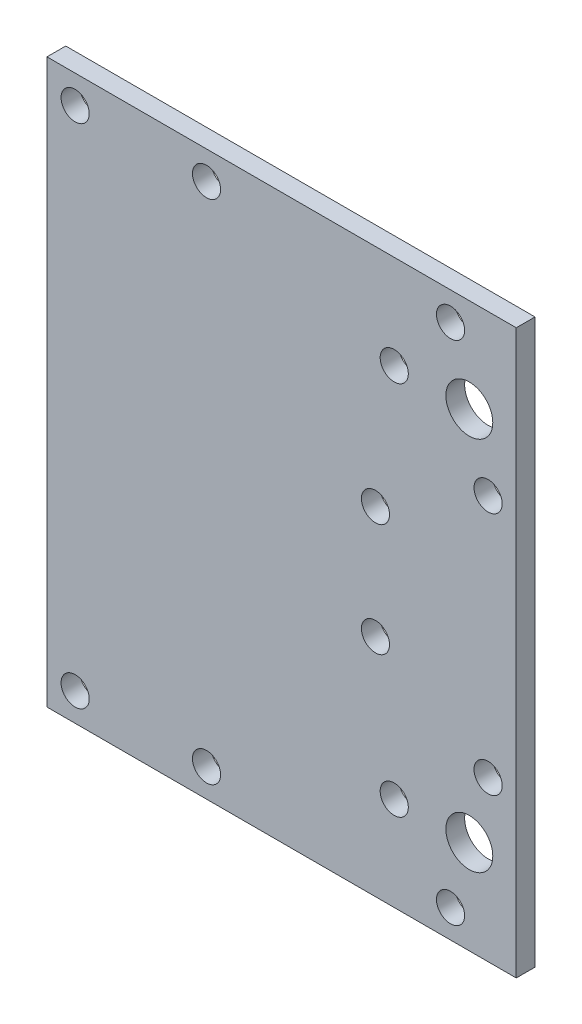
ISO-10303-21;
HEADER;
FILE_DESCRIPTION(('STEP AP214'),'2;1');
FILE_NAME('part.step','',(''),(''),'','','');
FILE_SCHEMA(('AUTOMOTIVE_DESIGN { 1 0 10303 214 1 1 1 1 }'));
ENDSEC;
DATA;
#1=APPLICATION_CONTEXT('core data for automotive mechanical design processes');
#2=APPLICATION_PROTOCOL_DEFINITION('international standard','automotive_design',2000,#1);
#3=PRODUCT_CONTEXT('',#1,'mechanical');
#4=PRODUCT('Part','Part','',(#3));
#5=PRODUCT_RELATED_PRODUCT_CATEGORY('part','',(#4));
#6=PRODUCT_DEFINITION_FORMATION('','',#4);
#7=PRODUCT_DEFINITION_CONTEXT('part definition',#1,'design');
#8=PRODUCT_DEFINITION('design','',#6,#7);
#9=PRODUCT_DEFINITION_SHAPE('','',#8);
#10=(LENGTH_UNIT() NAMED_UNIT(*) SI_UNIT(.MILLI.,.METRE.));
#11=(NAMED_UNIT(*) PLANE_ANGLE_UNIT() SI_UNIT($,.RADIAN.));
#12=(NAMED_UNIT(*) SI_UNIT($,.STERADIAN.) SOLID_ANGLE_UNIT());
#13=UNCERTAINTY_MEASURE_WITH_UNIT(LENGTH_MEASURE(1.E-05),#10,'distance_accuracy_value','');
#14=(GEOMETRIC_REPRESENTATION_CONTEXT(3) GLOBAL_UNCERTAINTY_ASSIGNED_CONTEXT((#13)) GLOBAL_UNIT_ASSIGNED_CONTEXT((#10,
#11,#12)) REPRESENTATION_CONTEXT('',''));
#15=CARTESIAN_POINT('',(0.,0.,0.));
#16=DIRECTION('',(0.,0.,1.));
#17=DIRECTION('',(1.,0.,0.));
#18=AXIS2_PLACEMENT_3D('',#15,#16,#17);
#19=CARTESIAN_POINT('',(0.,0.,2.));
#20=DIRECTION('',(0.,0.,-1.));
#21=DIRECTION('',(-1.,0.,0.));
#22=AXIS2_PLACEMENT_3D('',#19,#20,#21);
#23=PLANE('',#22);
#24=CARTESIAN_POINT('',(45.,50.,2.));
#25=DIRECTION('',(0.,0.,1.));
#26=DIRECTION('',(1.,0.,0.));
#27=AXIS2_PLACEMENT_3D('',#24,#25,#26);
#28=CIRCLE('',#27,2.5);
#29=CARTESIAN_POINT('',(47.5,50.,2.));
#30=VERTEX_POINT('',#29);
#31=EDGE_CURVE('E193',#30,#30,#28,.T.);
#32=ORIENTED_EDGE('',*,*,#31,.F.);
#33=EDGE_LOOP('',(#32));
#34=FACE_BOUND('',#33,.T.);
#35=CARTESIAN_POINT('',(37.,50.,2.));
#36=DIRECTION('',(0.,0.,1.));
#37=DIRECTION('',(1.,0.,0.));
#38=AXIS2_PLACEMENT_3D('',#35,#36,#37);
#39=CIRCLE('',#38,1.5);
#40=CARTESIAN_POINT('',(38.5,50.,2.));
#41=VERTEX_POINT('',#40);
#42=EDGE_CURVE('E181',#41,#41,#39,.T.);
#43=ORIENTED_EDGE('',*,*,#42,.F.);
#44=EDGE_LOOP('',(#43));
#45=FACE_BOUND('',#44,.T.);
#46=CARTESIAN_POINT('',(35.,24.,2.));
#47=DIRECTION('',(0.,0.,1.));
#48=DIRECTION('',(1.,0.,0.));
#49=AXIS2_PLACEMENT_3D('',#46,#47,#48);
#50=CIRCLE('',#49,1.5);
#51=CARTESIAN_POINT('',(36.5,24.,2.));
#52=VERTEX_POINT('',#51);
#53=EDGE_CURVE('E169',#52,#52,#50,.T.);
#54=ORIENTED_EDGE('',*,*,#53,.F.);
#55=EDGE_LOOP('',(#54));
#56=FACE_BOUND('',#55,.T.);
#57=CARTESIAN_POINT('',(47.,43.,2.));
#58=DIRECTION('',(0.,0.,1.));
#59=DIRECTION('',(1.,0.,0.));
#60=AXIS2_PLACEMENT_3D('',#57,#58,#59);
#61=CIRCLE('',#60,1.5);
#62=CARTESIAN_POINT('',(48.5,43.,2.));
#63=VERTEX_POINT('',#62);
#64=EDGE_CURVE('E157',#63,#63,#61,.T.);
#65=ORIENTED_EDGE('',*,*,#64,.F.);
#66=EDGE_LOOP('',(#65));
#67=FACE_BOUND('',#66,.T.);
#68=CARTESIAN_POINT('',(47.,17.,2.));
#69=DIRECTION('',(0.,0.,1.));
#70=DIRECTION('',(1.,0.,0.));
#71=AXIS2_PLACEMENT_3D('',#68,#69,#70);
#72=CIRCLE('',#71,1.5);
#73=CARTESIAN_POINT('',(48.5,17.,2.));
#74=VERTEX_POINT('',#73);
#75=EDGE_CURVE('E145',#74,#74,#72,.T.);
#76=ORIENTED_EDGE('',*,*,#75,.F.);
#77=EDGE_LOOP('',(#76));
#78=FACE_BOUND('',#77,.T.);
#79=CARTESIAN_POINT('',(17.,3.,2.));
#80=DIRECTION('',(0.,0.,1.));
#81=DIRECTION('',(1.,0.,0.));
#82=AXIS2_PLACEMENT_3D('',#79,#80,#81);
#83=CIRCLE('',#82,1.5);
#84=CARTESIAN_POINT('',(18.5,3.,2.));
#85=VERTEX_POINT('',#84);
#86=EDGE_CURVE('E133',#85,#85,#83,.T.);
#87=ORIENTED_EDGE('',*,*,#86,.F.);
#88=EDGE_LOOP('',(#87));
#89=FACE_BOUND('',#88,.T.);
#90=CARTESIAN_POINT('',(3.,57.,2.));
#91=DIRECTION('',(0.,0.,1.));
#92=DIRECTION('',(1.,0.,0.));
#93=AXIS2_PLACEMENT_3D('',#90,#91,#92);
#94=CIRCLE('',#93,1.5);
#95=CARTESIAN_POINT('',(4.5,57.,2.));
#96=VERTEX_POINT('',#95);
#97=EDGE_CURVE('E112',#96,#96,#94,.T.);
#98=ORIENTED_EDGE('',*,*,#97,.F.);
#99=EDGE_LOOP('',(#98));
#100=FACE_BOUND('',#99,.T.);
#101=DIRECTION('',(0.,-1.,0.));
#102=VECTOR('',#101,1.);
#103=CARTESIAN_POINT('',(0.,0.,2.));
#104=LINE('',#103,#102);
#105=CARTESIAN_POINT('',(0.,60.,2.));
#106=VERTEX_POINT('',#105);
#107=CARTESIAN_POINT('',(0.,0.,2.));
#108=VERTEX_POINT('',#107);
#109=EDGE_CURVE('E97',#106,#108,#104,.T.);
#110=ORIENTED_EDGE('',*,*,#109,.T.);
#111=DIRECTION('',(1.,0.,0.));
#112=VECTOR('',#111,1.);
#113=CARTESIAN_POINT('',(0.,0.,2.));
#114=LINE('',#113,#112);
#115=CARTESIAN_POINT('',(50.,0.,2.));
#116=VERTEX_POINT('',#115);
#117=EDGE_CURVE('E92',#108,#116,#114,.T.);
#118=ORIENTED_EDGE('',*,*,#117,.T.);
#119=DIRECTION('',(0.,1.,0.));
#120=VECTOR('',#119,1.);
#121=CARTESIAN_POINT('',(50.,0.,2.));
#122=LINE('',#121,#120);
#123=CARTESIAN_POINT('',(50.,60.,2.));
#124=VERTEX_POINT('',#123);
#125=EDGE_CURVE('E95',#116,#124,#122,.T.);
#126=ORIENTED_EDGE('',*,*,#125,.T.);
#127=DIRECTION('',(-1.,0.,0.));
#128=VECTOR('',#127,1.);
#129=CARTESIAN_POINT('',(0.,60.,2.));
#130=LINE('',#129,#128);
#131=EDGE_CURVE('E62',#124,#106,#130,.T.);
#132=ORIENTED_EDGE('',*,*,#131,.T.);
#133=EDGE_LOOP('',(#110,#118,#126,#132));
#134=FACE_BOUND('',#133,.T.);
#135=CARTESIAN_POINT('',(17.,57.,2.));
#136=DIRECTION('',(0.,0.,1.));
#137=DIRECTION('',(1.,0.,0.));
#138=AXIS2_PLACEMENT_3D('',#135,#136,#137);
#139=CIRCLE('',#138,1.5);
#140=CARTESIAN_POINT('',(18.5,57.,2.));
#141=VERTEX_POINT('',#140);
#142=EDGE_CURVE('E127',#141,#141,#139,.T.);
#143=ORIENTED_EDGE('',*,*,#142,.F.);
#144=EDGE_LOOP('',(#143));
#145=FACE_BOUND('',#144,.T.);
#146=CARTESIAN_POINT('',(3.,3.,2.));
#147=DIRECTION('',(0.,0.,1.));
#148=DIRECTION('',(1.,0.,0.));
#149=AXIS2_PLACEMENT_3D('',#146,#147,#148);
#150=CIRCLE('',#149,1.5);
#151=CARTESIAN_POINT('',(4.5,3.,2.));
#152=VERTEX_POINT('',#151);
#153=EDGE_CURVE('E139',#152,#152,#150,.T.);
#154=ORIENTED_EDGE('',*,*,#153,.F.);
#155=EDGE_LOOP('',(#154));
#156=FACE_BOUND('',#155,.T.);
#157=CARTESIAN_POINT('',(43.,3.,2.));
#158=DIRECTION('',(0.,0.,1.));
#159=DIRECTION('',(1.,0.,0.));
#160=AXIS2_PLACEMENT_3D('',#157,#158,#159);
#161=CIRCLE('',#160,1.5);
#162=CARTESIAN_POINT('',(44.5,3.,2.));
#163=VERTEX_POINT('',#162);
#164=EDGE_CURVE('E151',#163,#163,#161,.T.);
#165=ORIENTED_EDGE('',*,*,#164,.F.);
#166=EDGE_LOOP('',(#165));
#167=FACE_BOUND('',#166,.T.);
#168=CARTESIAN_POINT('',(43.,57.,2.));
#169=DIRECTION('',(0.,0.,1.));
#170=DIRECTION('',(1.,0.,0.));
#171=AXIS2_PLACEMENT_3D('',#168,#169,#170);
#172=CIRCLE('',#171,1.5);
#173=CARTESIAN_POINT('',(44.5,57.,2.));
#174=VERTEX_POINT('',#173);
#175=EDGE_CURVE('E163',#174,#174,#172,.T.);
#176=ORIENTED_EDGE('',*,*,#175,.F.);
#177=EDGE_LOOP('',(#176));
#178=FACE_BOUND('',#177,.T.);
#179=CARTESIAN_POINT('',(35.,36.,2.));
#180=DIRECTION('',(0.,0.,1.));
#181=DIRECTION('',(1.,0.,0.));
#182=AXIS2_PLACEMENT_3D('',#179,#180,#181);
#183=CIRCLE('',#182,1.5);
#184=CARTESIAN_POINT('',(36.5,36.,2.));
#185=VERTEX_POINT('',#184);
#186=EDGE_CURVE('E175',#185,#185,#183,.T.);
#187=ORIENTED_EDGE('',*,*,#186,.F.);
#188=EDGE_LOOP('',(#187));
#189=FACE_BOUND('',#188,.T.);
#190=CARTESIAN_POINT('',(37.,10.,2.));
#191=DIRECTION('',(0.,0.,1.));
#192=DIRECTION('',(1.,0.,0.));
#193=AXIS2_PLACEMENT_3D('',#190,#191,#192);
#194=CIRCLE('',#193,1.5);
#195=CARTESIAN_POINT('',(38.5,10.,2.));
#196=VERTEX_POINT('',#195);
#197=EDGE_CURVE('E187',#196,#196,#194,.T.);
#198=ORIENTED_EDGE('',*,*,#197,.F.);
#199=EDGE_LOOP('',(#198));
#200=FACE_BOUND('',#199,.T.);
#201=CARTESIAN_POINT('',(45.,10.,2.));
#202=DIRECTION('',(0.,0.,1.));
#203=DIRECTION('',(1.,0.,0.));
#204=AXIS2_PLACEMENT_3D('',#201,#202,#203);
#205=CIRCLE('',#204,2.5);
#206=CARTESIAN_POINT('',(47.5,10.,2.));
#207=VERTEX_POINT('',#206);
#208=EDGE_CURVE('E199',#207,#207,#205,.T.);
#209=ORIENTED_EDGE('',*,*,#208,.F.);
#210=EDGE_LOOP('',(#209));
#211=FACE_BOUND('',#210,.T.);
#212=ADVANCED_FACE('F45',(#34,#45,#56,#67,#78,#89,#100,#134,#145,#156,#167,#178,#189,#200,#211),
#23,.F.);
#213=CARTESIAN_POINT('',(0.,0.,0.));
#214=DIRECTION('',(0.,0.,-1.));
#215=DIRECTION('',(-1.,0.,0.));
#216=AXIS2_PLACEMENT_3D('',#213,#214,#215);
#217=PLANE('',#216);
#218=CARTESIAN_POINT('',(45.,50.,0.));
#219=DIRECTION('',(0.,0.,1.));
#220=DIRECTION('',(1.,0.,0.));
#221=AXIS2_PLACEMENT_3D('',#218,#219,#220);
#222=CIRCLE('',#221,2.5);
#223=CARTESIAN_POINT('',(47.5,50.,0.));
#224=VERTEX_POINT('',#223);
#225=EDGE_CURVE('E196',#224,#224,#222,.T.);
#226=ORIENTED_EDGE('',*,*,#225,.T.);
#227=EDGE_LOOP('',(#226));
#228=FACE_BOUND('',#227,.T.);
#229=CARTESIAN_POINT('',(37.,50.,0.));
#230=DIRECTION('',(0.,0.,1.));
#231=DIRECTION('',(1.,0.,0.));
#232=AXIS2_PLACEMENT_3D('',#229,#230,#231);
#233=CIRCLE('',#232,1.5);
#234=CARTESIAN_POINT('',(38.5,50.,0.));
#235=VERTEX_POINT('',#234);
#236=EDGE_CURVE('E184',#235,#235,#233,.T.);
#237=ORIENTED_EDGE('',*,*,#236,.T.);
#238=EDGE_LOOP('',(#237));
#239=FACE_BOUND('',#238,.T.);
#240=CARTESIAN_POINT('',(35.,24.,0.));
#241=DIRECTION('',(0.,0.,1.));
#242=DIRECTION('',(1.,0.,0.));
#243=AXIS2_PLACEMENT_3D('',#240,#241,#242);
#244=CIRCLE('',#243,1.5);
#245=CARTESIAN_POINT('',(36.5,24.,0.));
#246=VERTEX_POINT('',#245);
#247=EDGE_CURVE('E172',#246,#246,#244,.T.);
#248=ORIENTED_EDGE('',*,*,#247,.T.);
#249=EDGE_LOOP('',(#248));
#250=FACE_BOUND('',#249,.T.);
#251=CARTESIAN_POINT('',(47.,43.,0.));
#252=DIRECTION('',(0.,0.,1.));
#253=DIRECTION('',(1.,0.,0.));
#254=AXIS2_PLACEMENT_3D('',#251,#252,#253);
#255=CIRCLE('',#254,1.5);
#256=CARTESIAN_POINT('',(48.5,43.,0.));
#257=VERTEX_POINT('',#256);
#258=EDGE_CURVE('E160',#257,#257,#255,.T.);
#259=ORIENTED_EDGE('',*,*,#258,.T.);
#260=EDGE_LOOP('',(#259));
#261=FACE_BOUND('',#260,.T.);
#262=CARTESIAN_POINT('',(47.,17.,0.));
#263=DIRECTION('',(0.,0.,1.));
#264=DIRECTION('',(1.,0.,0.));
#265=AXIS2_PLACEMENT_3D('',#262,#263,#264);
#266=CIRCLE('',#265,1.5);
#267=CARTESIAN_POINT('',(48.5,17.,0.));
#268=VERTEX_POINT('',#267);
#269=EDGE_CURVE('E148',#268,#268,#266,.T.);
#270=ORIENTED_EDGE('',*,*,#269,.T.);
#271=EDGE_LOOP('',(#270));
#272=FACE_BOUND('',#271,.T.);
#273=CARTESIAN_POINT('',(17.,3.,0.));
#274=DIRECTION('',(0.,0.,1.));
#275=DIRECTION('',(1.,0.,0.));
#276=AXIS2_PLACEMENT_3D('',#273,#274,#275);
#277=CIRCLE('',#276,1.5);
#278=CARTESIAN_POINT('',(18.5,3.,0.));
#279=VERTEX_POINT('',#278);
#280=EDGE_CURVE('E136',#279,#279,#277,.T.);
#281=ORIENTED_EDGE('',*,*,#280,.T.);
#282=EDGE_LOOP('',(#281));
#283=FACE_BOUND('',#282,.T.);
#284=CARTESIAN_POINT('',(3.,57.,0.));
#285=DIRECTION('',(0.,0.,1.));
#286=DIRECTION('',(1.,0.,0.));
#287=AXIS2_PLACEMENT_3D('',#284,#285,#286);
#288=CIRCLE('',#287,1.5);
#289=CARTESIAN_POINT('',(4.5,57.,0.));
#290=VERTEX_POINT('',#289);
#291=EDGE_CURVE('E124',#290,#290,#288,.T.);
#292=ORIENTED_EDGE('',*,*,#291,.T.);
#293=EDGE_LOOP('',(#292));
#294=FACE_BOUND('',#293,.T.);
#295=DIRECTION('',(0.,-1.,0.));
#296=VECTOR('',#295,1.);
#297=CARTESIAN_POINT('',(0.,0.,0.));
#298=LINE('',#297,#296);
#299=CARTESIAN_POINT('',(0.,60.,0.));
#300=VERTEX_POINT('',#299);
#301=CARTESIAN_POINT('',(0.,0.,0.));
#302=VERTEX_POINT('',#301);
#303=EDGE_CURVE('E109',#300,#302,#298,.T.);
#304=ORIENTED_EDGE('',*,*,#303,.F.);
#305=DIRECTION('',(-1.,0.,0.));
#306=VECTOR('',#305,1.);
#307=CARTESIAN_POINT('',(0.,60.,0.));
#308=LINE('',#307,#306);
#309=CARTESIAN_POINT('',(50.,60.,0.));
#310=VERTEX_POINT('',#309);
#311=EDGE_CURVE('E85',#310,#300,#308,.T.);
#312=ORIENTED_EDGE('',*,*,#311,.F.);
#313=DIRECTION('',(0.,1.,0.));
#314=VECTOR('',#313,1.);
#315=CARTESIAN_POINT('',(50.,0.,0.));
#316=LINE('',#315,#314);
#317=CARTESIAN_POINT('',(50.,0.,0.));
#318=VERTEX_POINT('',#317);
#319=EDGE_CURVE('E79',#318,#310,#316,.T.);
#320=ORIENTED_EDGE('',*,*,#319,.F.);
#321=DIRECTION('',(1.,0.,0.));
#322=VECTOR('',#321,1.);
#323=CARTESIAN_POINT('',(0.,0.,0.));
#324=LINE('',#323,#322);
#325=EDGE_CURVE('E101',#302,#318,#324,.T.);
#326=ORIENTED_EDGE('',*,*,#325,.F.);
#327=EDGE_LOOP('',(#304,#312,#320,#326));
#328=FACE_BOUND('',#327,.T.);
#329=CARTESIAN_POINT('',(17.,57.,0.));
#330=DIRECTION('',(0.,0.,1.));
#331=DIRECTION('',(1.,0.,0.));
#332=AXIS2_PLACEMENT_3D('',#329,#330,#331);
#333=CIRCLE('',#332,1.5);
#334=CARTESIAN_POINT('',(18.5,57.,0.));
#335=VERTEX_POINT('',#334);
#336=EDGE_CURVE('E130',#335,#335,#333,.T.);
#337=ORIENTED_EDGE('',*,*,#336,.T.);
#338=EDGE_LOOP('',(#337));
#339=FACE_BOUND('',#338,.T.);
#340=CARTESIAN_POINT('',(3.,3.,0.));
#341=DIRECTION('',(0.,0.,1.));
#342=DIRECTION('',(1.,0.,0.));
#343=AXIS2_PLACEMENT_3D('',#340,#341,#342);
#344=CIRCLE('',#343,1.5);
#345=CARTESIAN_POINT('',(4.5,3.,0.));
#346=VERTEX_POINT('',#345);
#347=EDGE_CURVE('E142',#346,#346,#344,.T.);
#348=ORIENTED_EDGE('',*,*,#347,.T.);
#349=EDGE_LOOP('',(#348));
#350=FACE_BOUND('',#349,.T.);
#351=CARTESIAN_POINT('',(43.,3.,0.));
#352=DIRECTION('',(0.,0.,1.));
#353=DIRECTION('',(1.,0.,0.));
#354=AXIS2_PLACEMENT_3D('',#351,#352,#353);
#355=CIRCLE('',#354,1.5);
#356=CARTESIAN_POINT('',(44.5,3.,0.));
#357=VERTEX_POINT('',#356);
#358=EDGE_CURVE('E154',#357,#357,#355,.T.);
#359=ORIENTED_EDGE('',*,*,#358,.T.);
#360=EDGE_LOOP('',(#359));
#361=FACE_BOUND('',#360,.T.);
#362=CARTESIAN_POINT('',(43.,57.,0.));
#363=DIRECTION('',(0.,0.,1.));
#364=DIRECTION('',(1.,0.,0.));
#365=AXIS2_PLACEMENT_3D('',#362,#363,#364);
#366=CIRCLE('',#365,1.5);
#367=CARTESIAN_POINT('',(44.5,57.,0.));
#368=VERTEX_POINT('',#367);
#369=EDGE_CURVE('E166',#368,#368,#366,.T.);
#370=ORIENTED_EDGE('',*,*,#369,.T.);
#371=EDGE_LOOP('',(#370));
#372=FACE_BOUND('',#371,.T.);
#373=CARTESIAN_POINT('',(35.,36.,0.));
#374=DIRECTION('',(0.,0.,1.));
#375=DIRECTION('',(1.,0.,0.));
#376=AXIS2_PLACEMENT_3D('',#373,#374,#375);
#377=CIRCLE('',#376,1.5);
#378=CARTESIAN_POINT('',(36.5,36.,0.));
#379=VERTEX_POINT('',#378);
#380=EDGE_CURVE('E178',#379,#379,#377,.T.);
#381=ORIENTED_EDGE('',*,*,#380,.T.);
#382=EDGE_LOOP('',(#381));
#383=FACE_BOUND('',#382,.T.);
#384=CARTESIAN_POINT('',(37.,10.,0.));
#385=DIRECTION('',(0.,0.,1.));
#386=DIRECTION('',(1.,0.,0.));
#387=AXIS2_PLACEMENT_3D('',#384,#385,#386);
#388=CIRCLE('',#387,1.5);
#389=CARTESIAN_POINT('',(38.5,10.,0.));
#390=VERTEX_POINT('',#389);
#391=EDGE_CURVE('E190',#390,#390,#388,.T.);
#392=ORIENTED_EDGE('',*,*,#391,.T.);
#393=EDGE_LOOP('',(#392));
#394=FACE_BOUND('',#393,.T.);
#395=CARTESIAN_POINT('',(45.,10.,0.));
#396=DIRECTION('',(0.,0.,1.));
#397=DIRECTION('',(1.,0.,0.));
#398=AXIS2_PLACEMENT_3D('',#395,#396,#397);
#399=CIRCLE('',#398,2.5);
#400=CARTESIAN_POINT('',(47.5,10.,0.));
#401=VERTEX_POINT('',#400);
#402=EDGE_CURVE('E202',#401,#401,#399,.T.);
#403=ORIENTED_EDGE('',*,*,#402,.T.);
#404=EDGE_LOOP('',(#403));
#405=FACE_BOUND('',#404,.T.);
#406=ADVANCED_FACE('F120',(#228,#239,#250,#261,#272,#283,#294,#328,#339,#350,#361,#372,#383,
#394,#405),#217,.T.);
#407=CARTESIAN_POINT('',(0.,0.,2.));
#408=DIRECTION('',(1.,0.,0.));
#409=DIRECTION('',(0.,0.,-1.));
#410=AXIS2_PLACEMENT_3D('',#407,#408,#409);
#411=PLANE('',#410);
#412=ORIENTED_EDGE('',*,*,#303,.T.);
#413=DIRECTION('',(0.,0.,-1.));
#414=VECTOR('',#413,1.);
#415=CARTESIAN_POINT('',(0.,0.,2.));
#416=LINE('',#415,#414);
#417=EDGE_CURVE('E13',#108,#302,#416,.T.);
#418=ORIENTED_EDGE('',*,*,#417,.F.);
#419=ORIENTED_EDGE('',*,*,#109,.F.);
#420=DIRECTION('',(0.,0.,-1.));
#421=VECTOR('',#420,1.);
#422=CARTESIAN_POINT('',(0.,60.,2.));
#423=LINE('',#422,#421);
#424=EDGE_CURVE('E105',#106,#300,#423,.T.);
#425=ORIENTED_EDGE('',*,*,#424,.T.);
#426=EDGE_LOOP('',(#412,#418,#419,#425));
#427=FACE_BOUND('',#426,.T.);
#428=ADVANCED_FACE('F47',(#427),#411,.F.);
#429=CARTESIAN_POINT('',(0.,0.,2.));
#430=DIRECTION('',(0.,1.,0.));
#431=DIRECTION('',(0.,0.,1.));
#432=AXIS2_PLACEMENT_3D('',#429,#430,#431);
#433=PLANE('',#432);
#434=ORIENTED_EDGE('',*,*,#325,.T.);
#435=DIRECTION('',(0.,0.,-1.));
#436=VECTOR('',#435,1.);
#437=CARTESIAN_POINT('',(50.,0.,2.));
#438=LINE('',#437,#436);
#439=EDGE_CURVE('E54',#116,#318,#438,.T.);
#440=ORIENTED_EDGE('',*,*,#439,.F.);
#441=ORIENTED_EDGE('',*,*,#117,.F.);
#442=ORIENTED_EDGE('',*,*,#417,.T.);
#443=EDGE_LOOP('',(#434,#440,#441,#442));
#444=FACE_BOUND('',#443,.T.);
#445=ADVANCED_FACE('F100',(#444),#433,.F.);
#446=CARTESIAN_POINT('',(50.,0.,2.));
#447=DIRECTION('',(-1.,0.,0.));
#448=DIRECTION('',(0.,0.,1.));
#449=AXIS2_PLACEMENT_3D('',#446,#447,#448);
#450=PLANE('',#449);
#451=ORIENTED_EDGE('',*,*,#319,.T.);
#452=DIRECTION('',(0.,0.,-1.));
#453=VECTOR('',#452,1.);
#454=CARTESIAN_POINT('',(50.,60.,2.));
#455=LINE('',#454,#453);
#456=EDGE_CURVE('E102',#124,#310,#455,.T.);
#457=ORIENTED_EDGE('',*,*,#456,.F.);
#458=ORIENTED_EDGE('',*,*,#125,.F.);
#459=ORIENTED_EDGE('',*,*,#439,.T.);
#460=EDGE_LOOP('',(#451,#457,#458,#459));
#461=FACE_BOUND('',#460,.T.);
#462=ADVANCED_FACE('F103',(#461),#450,.F.);
#463=CARTESIAN_POINT('',(0.,60.,2.));
#464=DIRECTION('',(0.,-1.,0.));
#465=DIRECTION('',(0.,0.,-1.));
#466=AXIS2_PLACEMENT_3D('',#463,#464,#465);
#467=PLANE('',#466);
#468=ORIENTED_EDGE('',*,*,#311,.T.);
#469=ORIENTED_EDGE('',*,*,#424,.F.);
#470=ORIENTED_EDGE('',*,*,#131,.F.);
#471=ORIENTED_EDGE('',*,*,#456,.T.);
#472=EDGE_LOOP('',(#468,#469,#470,#471));
#473=FACE_BOUND('',#472,.T.);
#474=ADVANCED_FACE('F117',(#473),#467,.F.);
#475=CARTESIAN_POINT('',(3.,57.,2.));
#476=DIRECTION('',(0.,0.,-1.));
#477=DIRECTION('',(-1.,0.,0.));
#478=AXIS2_PLACEMENT_3D('',#475,#476,#477);
#479=CYLINDRICAL_SURFACE('',#478,1.5);
#480=ORIENTED_EDGE('',*,*,#97,.T.);
#481=EDGE_LOOP('',(#480));
#482=FACE_BOUND('',#481,.T.);
#483=ORIENTED_EDGE('',*,*,#291,.F.);
#484=EDGE_LOOP('',(#483));
#485=FACE_BOUND('',#484,.T.);
#486=ADVANCED_FACE('F222',(#482,#485),#479,.F.);
#487=CARTESIAN_POINT('',(17.,57.,2.));
#488=DIRECTION('',(0.,0.,-1.));
#489=DIRECTION('',(-1.,0.,0.));
#490=AXIS2_PLACEMENT_3D('',#487,#488,#489);
#491=CYLINDRICAL_SURFACE('',#490,1.5);
#492=ORIENTED_EDGE('',*,*,#142,.T.);
#493=EDGE_LOOP('',(#492));
#494=FACE_BOUND('',#493,.T.);
#495=ORIENTED_EDGE('',*,*,#336,.F.);
#496=EDGE_LOOP('',(#495));
#497=FACE_BOUND('',#496,.T.);
#498=ADVANCED_FACE('F268',(#494,#497),#491,.F.);
#499=CARTESIAN_POINT('',(17.,3.,2.));
#500=DIRECTION('',(0.,0.,-1.));
#501=DIRECTION('',(-1.,0.,0.));
#502=AXIS2_PLACEMENT_3D('',#499,#500,#501);
#503=CYLINDRICAL_SURFACE('',#502,1.5);
#504=ORIENTED_EDGE('',*,*,#86,.T.);
#505=EDGE_LOOP('',(#504));
#506=FACE_BOUND('',#505,.T.);
#507=ORIENTED_EDGE('',*,*,#280,.F.);
#508=EDGE_LOOP('',(#507));
#509=FACE_BOUND('',#508,.T.);
#510=ADVANCED_FACE('F276',(#506,#509),#503,.F.);
#511=CARTESIAN_POINT('',(3.,3.,2.));
#512=DIRECTION('',(0.,0.,-1.));
#513=DIRECTION('',(-1.,0.,0.));
#514=AXIS2_PLACEMENT_3D('',#511,#512,#513);
#515=CYLINDRICAL_SURFACE('',#514,1.5);
#516=ORIENTED_EDGE('',*,*,#153,.T.);
#517=EDGE_LOOP('',(#516));
#518=FACE_BOUND('',#517,.T.);
#519=ORIENTED_EDGE('',*,*,#347,.F.);
#520=EDGE_LOOP('',(#519));
#521=FACE_BOUND('',#520,.T.);
#522=ADVANCED_FACE('F284',(#518,#521),#515,.F.);
#523=CARTESIAN_POINT('',(47.,17.,2.));
#524=DIRECTION('',(0.,0.,-1.));
#525=DIRECTION('',(-1.,0.,0.));
#526=AXIS2_PLACEMENT_3D('',#523,#524,#525);
#527=CYLINDRICAL_SURFACE('',#526,1.5);
#528=ORIENTED_EDGE('',*,*,#75,.T.);
#529=EDGE_LOOP('',(#528));
#530=FACE_BOUND('',#529,.T.);
#531=ORIENTED_EDGE('',*,*,#269,.F.);
#532=EDGE_LOOP('',(#531));
#533=FACE_BOUND('',#532,.T.);
#534=ADVANCED_FACE('F293',(#530,#533),#527,.F.);
#535=CARTESIAN_POINT('',(43.,3.,2.));
#536=DIRECTION('',(0.,0.,-1.));
#537=DIRECTION('',(-1.,0.,0.));
#538=AXIS2_PLACEMENT_3D('',#535,#536,#537);
#539=CYLINDRICAL_SURFACE('',#538,1.5);
#540=ORIENTED_EDGE('',*,*,#164,.T.);
#541=EDGE_LOOP('',(#540));
#542=FACE_BOUND('',#541,.T.);
#543=ORIENTED_EDGE('',*,*,#358,.F.);
#544=EDGE_LOOP('',(#543));
#545=FACE_BOUND('',#544,.T.);
#546=ADVANCED_FACE('F302',(#542,#545),#539,.F.);
#547=CARTESIAN_POINT('',(47.,43.,2.));
#548=DIRECTION('',(0.,0.,-1.));
#549=DIRECTION('',(-1.,0.,0.));
#550=AXIS2_PLACEMENT_3D('',#547,#548,#549);
#551=CYLINDRICAL_SURFACE('',#550,1.5);
#552=ORIENTED_EDGE('',*,*,#64,.T.);
#553=EDGE_LOOP('',(#552));
#554=FACE_BOUND('',#553,.T.);
#555=ORIENTED_EDGE('',*,*,#258,.F.);
#556=EDGE_LOOP('',(#555));
#557=FACE_BOUND('',#556,.T.);
#558=ADVANCED_FACE('F311',(#554,#557),#551,.F.);
#559=CARTESIAN_POINT('',(43.,57.,2.));
#560=DIRECTION('',(0.,0.,-1.));
#561=DIRECTION('',(-1.,0.,0.));
#562=AXIS2_PLACEMENT_3D('',#559,#560,#561);
#563=CYLINDRICAL_SURFACE('',#562,1.5);
#564=ORIENTED_EDGE('',*,*,#175,.T.);
#565=EDGE_LOOP('',(#564));
#566=FACE_BOUND('',#565,.T.);
#567=ORIENTED_EDGE('',*,*,#369,.F.);
#568=EDGE_LOOP('',(#567));
#569=FACE_BOUND('',#568,.T.);
#570=ADVANCED_FACE('F320',(#566,#569),#563,.F.);
#571=CARTESIAN_POINT('',(35.,24.,2.));
#572=DIRECTION('',(0.,0.,-1.));
#573=DIRECTION('',(-1.,0.,0.));
#574=AXIS2_PLACEMENT_3D('',#571,#572,#573);
#575=CYLINDRICAL_SURFACE('',#574,1.5);
#576=ORIENTED_EDGE('',*,*,#53,.T.);
#577=EDGE_LOOP('',(#576));
#578=FACE_BOUND('',#577,.T.);
#579=ORIENTED_EDGE('',*,*,#247,.F.);
#580=EDGE_LOOP('',(#579));
#581=FACE_BOUND('',#580,.T.);
#582=ADVANCED_FACE('F329',(#578,#581),#575,.F.);
#583=CARTESIAN_POINT('',(35.,36.,2.));
#584=DIRECTION('',(0.,0.,-1.));
#585=DIRECTION('',(-1.,0.,0.));
#586=AXIS2_PLACEMENT_3D('',#583,#584,#585);
#587=CYLINDRICAL_SURFACE('',#586,1.5);
#588=ORIENTED_EDGE('',*,*,#186,.T.);
#589=EDGE_LOOP('',(#588));
#590=FACE_BOUND('',#589,.T.);
#591=ORIENTED_EDGE('',*,*,#380,.F.);
#592=EDGE_LOOP('',(#591));
#593=FACE_BOUND('',#592,.T.);
#594=ADVANCED_FACE('F338',(#590,#593),#587,.F.);
#595=CARTESIAN_POINT('',(37.,50.,2.));
#596=DIRECTION('',(0.,0.,-1.));
#597=DIRECTION('',(-1.,0.,0.));
#598=AXIS2_PLACEMENT_3D('',#595,#596,#597);
#599=CYLINDRICAL_SURFACE('',#598,1.5);
#600=ORIENTED_EDGE('',*,*,#42,.T.);
#601=EDGE_LOOP('',(#600));
#602=FACE_BOUND('',#601,.T.);
#603=ORIENTED_EDGE('',*,*,#236,.F.);
#604=EDGE_LOOP('',(#603));
#605=FACE_BOUND('',#604,.T.);
#606=ADVANCED_FACE('F347',(#602,#605),#599,.F.);
#607=CARTESIAN_POINT('',(37.,10.,2.));
#608=DIRECTION('',(0.,0.,-1.));
#609=DIRECTION('',(-1.,0.,0.));
#610=AXIS2_PLACEMENT_3D('',#607,#608,#609);
#611=CYLINDRICAL_SURFACE('',#610,1.5);
#612=ORIENTED_EDGE('',*,*,#197,.T.);
#613=EDGE_LOOP('',(#612));
#614=FACE_BOUND('',#613,.T.);
#615=ORIENTED_EDGE('',*,*,#391,.F.);
#616=EDGE_LOOP('',(#615));
#617=FACE_BOUND('',#616,.T.);
#618=ADVANCED_FACE('F356',(#614,#617),#611,.F.);
#619=CARTESIAN_POINT('',(45.,50.,2.));
#620=DIRECTION('',(0.,0.,-1.));
#621=DIRECTION('',(-1.,0.,0.));
#622=AXIS2_PLACEMENT_3D('',#619,#620,#621);
#623=CYLINDRICAL_SURFACE('',#622,2.5);
#624=ORIENTED_EDGE('',*,*,#31,.T.);
#625=EDGE_LOOP('',(#624));
#626=FACE_BOUND('',#625,.T.);
#627=ORIENTED_EDGE('',*,*,#225,.F.);
#628=EDGE_LOOP('',(#627));
#629=FACE_BOUND('',#628,.T.);
#630=ADVANCED_FACE('F365',(#626,#629),#623,.F.);
#631=CARTESIAN_POINT('',(45.,10.,2.));
#632=DIRECTION('',(0.,0.,-1.));
#633=DIRECTION('',(-1.,0.,0.));
#634=AXIS2_PLACEMENT_3D('',#631,#632,#633);
#635=CYLINDRICAL_SURFACE('',#634,2.5);
#636=ORIENTED_EDGE('',*,*,#208,.T.);
#637=EDGE_LOOP('',(#636));
#638=FACE_BOUND('',#637,.T.);
#639=ORIENTED_EDGE('',*,*,#402,.F.);
#640=EDGE_LOOP('',(#639));
#641=FACE_BOUND('',#640,.T.);
#642=ADVANCED_FACE('F208',(#638,#641),#635,.F.);
#643=CLOSED_SHELL('',(#212,#406,#428,#445,#462,#474,#486,#498,#510,#522,#534,#546,#558,#570,
#582,#594,#606,#618,#630,#642));
#644=MANIFOLD_SOLID_BREP('B2',#643);
#645=ADVANCED_BREP_SHAPE_REPRESENTATION('',(#18,#644),#14);
#646=SHAPE_DEFINITION_REPRESENTATION(#9,#645);
ENDSEC;
END-ISO-10303-21;
